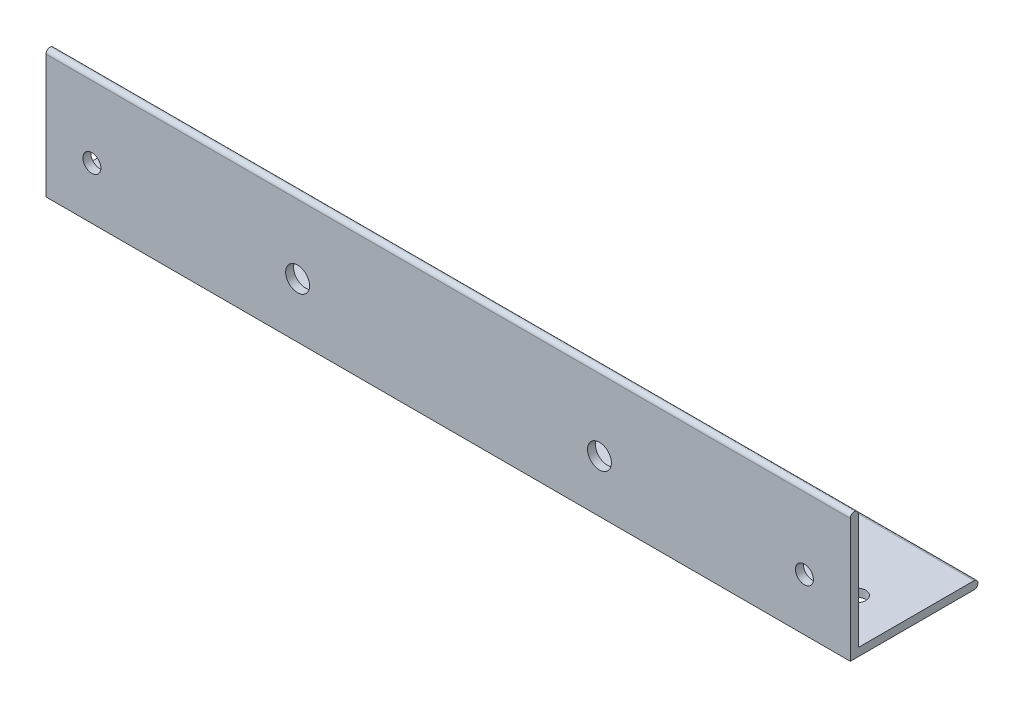
ISO-10303-21;
HEADER;
FILE_DESCRIPTION(('STEP AP214'),'2;1');
FILE_NAME('part.step','',(''),(''),'','','');
FILE_SCHEMA(('AUTOMOTIVE_DESIGN { 1 0 10303 214 1 1 1 1 }'));
ENDSEC;
DATA;
#1=APPLICATION_CONTEXT('core data for automotive mechanical design processes');
#2=APPLICATION_PROTOCOL_DEFINITION('international standard','automotive_design',2000,#1);
#3=PRODUCT_CONTEXT('',#1,'mechanical');
#4=PRODUCT('Part','Part','',(#3));
#5=PRODUCT_RELATED_PRODUCT_CATEGORY('part','',(#4));
#6=PRODUCT_DEFINITION_FORMATION('','',#4);
#7=PRODUCT_DEFINITION_CONTEXT('part definition',#1,'design');
#8=PRODUCT_DEFINITION('design','',#6,#7);
#9=PRODUCT_DEFINITION_SHAPE('','',#8);
#10=(LENGTH_UNIT() NAMED_UNIT(*) SI_UNIT(.MILLI.,.METRE.));
#11=(NAMED_UNIT(*) PLANE_ANGLE_UNIT() SI_UNIT($,.RADIAN.));
#12=(NAMED_UNIT(*) SI_UNIT($,.STERADIAN.) SOLID_ANGLE_UNIT());
#13=UNCERTAINTY_MEASURE_WITH_UNIT(LENGTH_MEASURE(1.E-05),#10,'distance_accuracy_value','');
#14=(GEOMETRIC_REPRESENTATION_CONTEXT(3) GLOBAL_UNCERTAINTY_ASSIGNED_CONTEXT((#13)) GLOBAL_UNIT_ASSIGNED_CONTEXT((#10,
#11,#12)) REPRESENTATION_CONTEXT('',''));
#15=CARTESIAN_POINT('',(0.,0.,0.));
#16=DIRECTION('',(0.,0.,1.));
#17=DIRECTION('',(1.,0.,0.));
#18=AXIS2_PLACEMENT_3D('',#15,#16,#17);
#19=CARTESIAN_POINT('',(160.,0.793749999999999,-24.60625));
#20=DIRECTION('',(-1.,0.,0.));
#21=DIRECTION('',(0.,0.,1.));
#22=AXIS2_PLACEMENT_3D('',#19,#20,#21);
#23=CYLINDRICAL_SURFACE('',#22,0.793749999999999);
#24=DIRECTION('',(-1.,0.,0.));
#25=VECTOR('',#24,1.);
#26=CARTESIAN_POINT('',(160.,1.5875,-24.60625));
#27=LINE('',#26,#25);
#28=CARTESIAN_POINT('',(160.,1.5875,-24.60625));
#29=VERTEX_POINT('',#28);
#30=CARTESIAN_POINT('',(0.,1.5875,-24.60625));
#31=VERTEX_POINT('',#30);
#32=EDGE_CURVE('E135',#29,#31,#27,.T.);
#33=ORIENTED_EDGE('',*,*,#32,.F.);
#34=CARTESIAN_POINT('',(160.,0.793749999999999,-24.60625));
#35=DIRECTION('',(-1.,0.,0.));
#36=DIRECTION('',(0.,0.,1.));
#37=AXIS2_PLACEMENT_3D('',#34,#35,#36);
#38=CIRCLE('',#37,0.793749999999999);
#39=CARTESIAN_POINT('',(160.,0.,-24.60625));
#40=VERTEX_POINT('',#39);
#41=EDGE_CURVE('E44',#40,#29,#38,.F.);
#42=ORIENTED_EDGE('',*,*,#41,.F.);
#43=DIRECTION('',(-1.,0.,0.));
#44=VECTOR('',#43,1.);
#45=CARTESIAN_POINT('',(160.,0.,-24.60625));
#46=LINE('',#45,#44);
#47=CARTESIAN_POINT('',(0.,0.,-24.60625));
#48=VERTEX_POINT('',#47);
#49=EDGE_CURVE('E137',#48,#40,#46,.F.);
#50=ORIENTED_EDGE('',*,*,#49,.F.);
#51=CARTESIAN_POINT('',(0.,0.793749999999999,-24.60625));
#52=DIRECTION('',(-1.,0.,0.));
#53=DIRECTION('',(0.,0.,1.));
#54=AXIS2_PLACEMENT_3D('',#51,#52,#53);
#55=CIRCLE('',#54,0.793749999999999);
#56=EDGE_CURVE('E11',#31,#48,#55,.T.);
#57=ORIENTED_EDGE('',*,*,#56,.F.);
#58=EDGE_LOOP('',(#33,#42,#50,#57));
#59=FACE_BOUND('',#58,.T.);
#60=ADVANCED_FACE('F35',(#59),#23,.T.);
#61=CARTESIAN_POINT('',(160.,24.60625,-0.79375));
#62=DIRECTION('',(-1.,0.,0.));
#63=DIRECTION('',(0.,0.,1.));
#64=AXIS2_PLACEMENT_3D('',#61,#62,#63);
#65=CYLINDRICAL_SURFACE('',#64,0.79375);
#66=DIRECTION('',(-1.,0.,0.));
#67=VECTOR('',#66,1.);
#68=CARTESIAN_POINT('',(160.,24.60625,0.));
#69=LINE('',#68,#67);
#70=CARTESIAN_POINT('',(160.,24.60625,0.));
#71=VERTEX_POINT('',#70);
#72=CARTESIAN_POINT('',(0.,24.60625,0.));
#73=VERTEX_POINT('',#72);
#74=EDGE_CURVE('E105',#71,#73,#69,.T.);
#75=ORIENTED_EDGE('',*,*,#74,.F.);
#76=CARTESIAN_POINT('',(160.,24.60625,-0.79375));
#77=DIRECTION('',(-1.,0.,0.));
#78=DIRECTION('',(0.,0.,1.));
#79=AXIS2_PLACEMENT_3D('',#76,#77,#78);
#80=CIRCLE('',#79,0.79375);
#81=CARTESIAN_POINT('',(160.,24.60625,-1.5875));
#82=VERTEX_POINT('',#81);
#83=EDGE_CURVE('E131',#82,#71,#80,.F.);
#84=ORIENTED_EDGE('',*,*,#83,.F.);
#85=DIRECTION('',(-1.,0.,0.));
#86=VECTOR('',#85,1.);
#87=CARTESIAN_POINT('',(160.,24.60625,-1.5875));
#88=LINE('',#87,#86);
#89=CARTESIAN_POINT('',(0.,24.60625,-1.5875));
#90=VERTEX_POINT('',#89);
#91=EDGE_CURVE('E111',#90,#82,#88,.F.);
#92=ORIENTED_EDGE('',*,*,#91,.F.);
#93=CARTESIAN_POINT('',(0.,24.60625,-0.79375));
#94=DIRECTION('',(-1.,0.,0.));
#95=DIRECTION('',(0.,0.,1.));
#96=AXIS2_PLACEMENT_3D('',#93,#94,#95);
#97=CIRCLE('',#96,0.79375);
#98=EDGE_CURVE('E133',#73,#90,#97,.T.);
#99=ORIENTED_EDGE('',*,*,#98,.F.);
#100=EDGE_LOOP('',(#75,#84,#92,#99));
#101=FACE_BOUND('',#100,.T.);
#102=ADVANCED_FACE('F196',(#101),#65,.T.);
#103=CARTESIAN_POINT('',(160.,0.,-25.4));
#104=DIRECTION('',(0.,1.,0.));
#105=DIRECTION('',(0.,0.,1.));
#106=AXIS2_PLACEMENT_3D('',#103,#104,#105);
#107=PLANE('',#106);
#108=CARTESIAN_POINT('',(55.,0.,-12.7));
#109=DIRECTION('',(0.,-1.,0.));
#110=DIRECTION('',(0.,0.,-1.));
#111=AXIS2_PLACEMENT_3D('',#108,#109,#110);
#112=CIRCLE('',#111,1.785);
#113=CARTESIAN_POINT('',(55.,0.,-14.485));
#114=VERTEX_POINT('',#113);
#115=EDGE_CURVE('E147',#114,#114,#112,.T.);
#116=ORIENTED_EDGE('',*,*,#115,.F.);
#117=EDGE_LOOP('',(#116));
#118=FACE_BOUND('',#117,.T.);
#119=CARTESIAN_POINT('',(105.,0.,-12.7));
#120=DIRECTION('',(0.,-1.,0.));
#121=DIRECTION('',(0.,0.,-1.));
#122=AXIS2_PLACEMENT_3D('',#119,#120,#121);
#123=CIRCLE('',#122,1.78499999999999);
#124=CARTESIAN_POINT('',(105.,0.,-14.485));
#125=VERTEX_POINT('',#124);
#126=EDGE_CURVE('E153',#125,#125,#123,.T.);
#127=ORIENTED_EDGE('',*,*,#126,.F.);
#128=EDGE_LOOP('',(#127));
#129=FACE_BOUND('',#128,.T.);
#130=CARTESIAN_POINT('',(9.13,0.,-10.41));
#131=DIRECTION('',(0.,-1.,0.));
#132=DIRECTION('',(0.,0.,1.));
#133=AXIS2_PLACEMENT_3D('',#130,#131,#132);
#134=CIRCLE('',#133,1.785);
#135=CARTESIAN_POINT('',(9.13,0.,-8.625));
#136=VERTEX_POINT('',#135);
#137=EDGE_CURVE('E143',#136,#136,#134,.T.);
#138=ORIENTED_EDGE('',*,*,#137,.F.);
#139=EDGE_LOOP('',(#138));
#140=FACE_BOUND('',#139,.T.);
#141=CARTESIAN_POINT('',(150.87,0.,-10.41));
#142=DIRECTION('',(0.,-1.,0.));
#143=DIRECTION('',(0.,0.,-1.));
#144=AXIS2_PLACEMENT_3D('',#141,#142,#143);
#145=CIRCLE('',#144,1.78500000000001);
#146=CARTESIAN_POINT('',(150.87,0.,-12.195));
#147=VERTEX_POINT('',#146);
#148=EDGE_CURVE('E181',#147,#147,#145,.T.);
#149=ORIENTED_EDGE('',*,*,#148,.F.);
#150=EDGE_LOOP('',(#149));
#151=FACE_BOUND('',#150,.T.);
#152=DIRECTION('',(0.,0.,-1.));
#153=VECTOR('',#152,1.);
#154=CARTESIAN_POINT('',(0.,0.,-25.4));
#155=LINE('',#154,#153);
#156=CARTESIAN_POINT('',(0.,0.,0.));
#157=VERTEX_POINT('',#156);
#158=EDGE_CURVE('E117',#157,#48,#155,.T.);
#159=ORIENTED_EDGE('',*,*,#158,.T.);
#160=ORIENTED_EDGE('',*,*,#49,.T.);
#161=DIRECTION('',(0.,0.,-1.));
#162=VECTOR('',#161,1.);
#163=CARTESIAN_POINT('',(160.,0.,-25.4));
#164=LINE('',#163,#162);
#165=CARTESIAN_POINT('',(160.,0.,0.));
#166=VERTEX_POINT('',#165);
#167=EDGE_CURVE('E96',#166,#40,#164,.T.);
#168=ORIENTED_EDGE('',*,*,#167,.F.);
#169=DIRECTION('',(-1.,0.,0.));
#170=VECTOR('',#169,1.);
#171=CARTESIAN_POINT('',(160.,0.,0.));
#172=LINE('',#171,#170);
#173=EDGE_CURVE('E106',#166,#157,#172,.T.);
#174=ORIENTED_EDGE('',*,*,#173,.T.);
#175=EDGE_LOOP('',(#159,#160,#168,#174));
#176=FACE_BOUND('',#175,.T.);
#177=ADVANCED_FACE('F191',(#118,#129,#140,#151,#176),#107,.F.);
#178=CARTESIAN_POINT('',(160.,1.5875,-1.5875));
#179=DIRECTION('',(0.,-1.,0.));
#180=DIRECTION('',(0.,0.,-1.));
#181=AXIS2_PLACEMENT_3D('',#178,#179,#180);
#182=PLANE('',#181);
#183=CARTESIAN_POINT('',(55.,1.5875,-12.7));
#184=DIRECTION('',(0.,-1.,0.));
#185=DIRECTION('',(0.,0.,-1.));
#186=AXIS2_PLACEMENT_3D('',#183,#184,#185);
#187=CIRCLE('',#186,1.785);
#188=CARTESIAN_POINT('',(55.,1.5875,-14.485));
#189=VERTEX_POINT('',#188);
#190=EDGE_CURVE('E39',#189,#189,#187,.T.);
#191=ORIENTED_EDGE('',*,*,#190,.T.);
#192=EDGE_LOOP('',(#191));
#193=FACE_BOUND('',#192,.T.);
#194=CARTESIAN_POINT('',(105.,1.5875,-12.7));
#195=DIRECTION('',(0.,-1.,0.));
#196=DIRECTION('',(0.,0.,-1.));
#197=AXIS2_PLACEMENT_3D('',#194,#195,#196);
#198=CIRCLE('',#197,1.78499999999999);
#199=CARTESIAN_POINT('',(105.,1.5875,-14.485));
#200=VERTEX_POINT('',#199);
#201=EDGE_CURVE('E145',#200,#200,#198,.T.);
#202=ORIENTED_EDGE('',*,*,#201,.T.);
#203=EDGE_LOOP('',(#202));
#204=FACE_BOUND('',#203,.T.);
#205=CARTESIAN_POINT('',(9.13,1.5875,-10.41));
#206=DIRECTION('',(0.,-1.,0.));
#207=DIRECTION('',(0.,0.,-1.));
#208=AXIS2_PLACEMENT_3D('',#205,#206,#207);
#209=CIRCLE('',#208,1.785);
#210=CARTESIAN_POINT('',(9.13,1.5875,-12.195));
#211=VERTEX_POINT('',#210);
#212=EDGE_CURVE('E120',#211,#211,#209,.T.);
#213=ORIENTED_EDGE('',*,*,#212,.T.);
#214=EDGE_LOOP('',(#213));
#215=FACE_BOUND('',#214,.T.);
#216=CARTESIAN_POINT('',(150.87,1.5875,-10.41));
#217=DIRECTION('',(0.,-1.,0.));
#218=DIRECTION('',(0.,0.,-1.));
#219=AXIS2_PLACEMENT_3D('',#216,#217,#218);
#220=CIRCLE('',#219,1.78500000000001);
#221=CARTESIAN_POINT('',(150.87,1.5875,-12.195));
#222=VERTEX_POINT('',#221);
#223=EDGE_CURVE('E140',#222,#222,#220,.T.);
#224=ORIENTED_EDGE('',*,*,#223,.T.);
#225=EDGE_LOOP('',(#224));
#226=FACE_BOUND('',#225,.T.);
#227=DIRECTION('',(0.,0.,1.));
#228=VECTOR('',#227,1.);
#229=CARTESIAN_POINT('',(160.,1.5875,-1.5875));
#230=LINE('',#229,#228);
#231=CARTESIAN_POINT('',(160.,1.5875,-1.5875));
#232=VERTEX_POINT('',#231);
#233=EDGE_CURVE('E88',#29,#232,#230,.T.);
#234=ORIENTED_EDGE('',*,*,#233,.F.);
#235=ORIENTED_EDGE('',*,*,#32,.T.);
#236=DIRECTION('',(0.,0.,1.));
#237=VECTOR('',#236,1.);
#238=CARTESIAN_POINT('',(0.,1.5875,-1.5875));
#239=LINE('',#238,#237);
#240=CARTESIAN_POINT('',(0.,1.5875,-1.5875));
#241=VERTEX_POINT('',#240);
#242=EDGE_CURVE('E101',#31,#241,#239,.T.);
#243=ORIENTED_EDGE('',*,*,#242,.T.);
#244=DIRECTION('',(-1.,0.,0.));
#245=VECTOR('',#244,1.);
#246=CARTESIAN_POINT('',(160.,1.5875,-1.5875));
#247=LINE('',#246,#245);
#248=EDGE_CURVE('E99',#232,#241,#247,.T.);
#249=ORIENTED_EDGE('',*,*,#248,.F.);
#250=EDGE_LOOP('',(#234,#235,#243,#249));
#251=FACE_BOUND('',#250,.T.);
#252=ADVANCED_FACE('F100',(#193,#204,#215,#226,#251),#182,.F.);
#253=CARTESIAN_POINT('',(160.,25.4,-1.5875));
#254=DIRECTION('',(0.,0.,1.));
#255=DIRECTION('',(0.,-1.,0.));
#256=AXIS2_PLACEMENT_3D('',#253,#254,#255);
#257=PLANE('',#256);
#258=CARTESIAN_POINT('',(50.05000042,10.905,-1.5875));
#259=DIRECTION('',(0.,0.,1.));
#260=DIRECTION('',(0.,-1.,0.));
#261=AXIS2_PLACEMENT_3D('',#258,#259,#260);
#262=CIRCLE('',#261,2.38125);
#263=CARTESIAN_POINT('',(50.05000042,8.52374999999999,-1.5875));
#264=VERTEX_POINT('',#263);
#265=EDGE_CURVE('E168',#264,#264,#262,.T.);
#266=ORIENTED_EDGE('',*,*,#265,.T.);
#267=EDGE_LOOP('',(#266));
#268=FACE_BOUND('',#267,.T.);
#269=CARTESIAN_POINT('',(110.09999958,10.405,-1.5875));
#270=DIRECTION('',(0.,0.,1.));
#271=DIRECTION('',(0.,-1.,0.));
#272=AXIS2_PLACEMENT_3D('',#269,#270,#271);
#273=CIRCLE('',#272,2.38125000000001);
#274=CARTESIAN_POINT('',(110.09999958,8.02374999999999,-1.5875));
#275=VERTEX_POINT('',#274);
#276=EDGE_CURVE('E163',#275,#275,#273,.T.);
#277=ORIENTED_EDGE('',*,*,#276,.T.);
#278=EDGE_LOOP('',(#277));
#279=FACE_BOUND('',#278,.T.);
#280=CARTESIAN_POINT('',(9.13,10.41,-1.5875));
#281=DIRECTION('',(0.,0.,1.));
#282=DIRECTION('',(0.,1.,0.));
#283=AXIS2_PLACEMENT_3D('',#280,#281,#282);
#284=CIRCLE('',#283,1.78500000000001);
#285=CARTESIAN_POINT('',(9.13,12.195,-1.5875));
#286=VERTEX_POINT('',#285);
#287=EDGE_CURVE('E171',#286,#286,#284,.T.);
#288=ORIENTED_EDGE('',*,*,#287,.T.);
#289=EDGE_LOOP('',(#288));
#290=FACE_BOUND('',#289,.T.);
#291=CARTESIAN_POINT('',(150.87,10.41,-1.5875));
#292=DIRECTION('',(0.,0.,-1.));
#293=DIRECTION('',(0.,1.,0.));
#294=AXIS2_PLACEMENT_3D('',#291,#292,#293);
#295=CIRCLE('',#294,1.78500000000001);
#296=CARTESIAN_POINT('',(150.87,12.195,-1.5875));
#297=VERTEX_POINT('',#296);
#298=EDGE_CURVE('E175',#297,#297,#295,.T.);
#299=ORIENTED_EDGE('',*,*,#298,.F.);
#300=EDGE_LOOP('',(#299));
#301=FACE_BOUND('',#300,.T.);
#302=DIRECTION('',(0.,1.,0.));
#303=VECTOR('',#302,1.);
#304=CARTESIAN_POINT('',(0.,25.4,-1.5875));
#305=LINE('',#304,#303);
#306=EDGE_CURVE('E122',#241,#90,#305,.T.);
#307=ORIENTED_EDGE('',*,*,#306,.T.);
#308=ORIENTED_EDGE('',*,*,#91,.T.);
#309=DIRECTION('',(0.,1.,0.));
#310=VECTOR('',#309,1.);
#311=CARTESIAN_POINT('',(160.,25.4,-1.5875));
#312=LINE('',#311,#310);
#313=EDGE_CURVE('E93',#232,#82,#312,.T.);
#314=ORIENTED_EDGE('',*,*,#313,.F.);
#315=ORIENTED_EDGE('',*,*,#248,.T.);
#316=EDGE_LOOP('',(#307,#308,#314,#315));
#317=FACE_BOUND('',#316,.T.);
#318=ADVANCED_FACE('F109',(#268,#279,#290,#301,#317),#257,.F.);
#319=CARTESIAN_POINT('',(160.,0.,0.));
#320=DIRECTION('',(0.,0.,-1.));
#321=DIRECTION('',(-1.,0.,0.));
#322=AXIS2_PLACEMENT_3D('',#319,#320,#321);
#323=PLANE('',#322);
#324=CARTESIAN_POINT('',(50.05000042,10.905,0.));
#325=DIRECTION('',(0.,0.,1.));
#326=DIRECTION('',(1.,0.,0.));
#327=AXIS2_PLACEMENT_3D('',#324,#325,#326);
#328=CIRCLE('',#327,2.38125);
#329=CARTESIAN_POINT('',(52.43125042,10.905,0.));
#330=VERTEX_POINT('',#329);
#331=EDGE_CURVE('E160',#330,#330,#328,.T.);
#332=ORIENTED_EDGE('',*,*,#331,.F.);
#333=EDGE_LOOP('',(#332));
#334=FACE_BOUND('',#333,.T.);
#335=CARTESIAN_POINT('',(110.09999958,10.405,0.));
#336=DIRECTION('',(0.,0.,1.));
#337=DIRECTION('',(1.,0.,0.));
#338=AXIS2_PLACEMENT_3D('',#335,#336,#337);
#339=CIRCLE('',#338,2.38125000000001);
#340=CARTESIAN_POINT('',(112.48124958,10.405,0.));
#341=VERTEX_POINT('',#340);
#342=EDGE_CURVE('E151',#341,#341,#339,.T.);
#343=ORIENTED_EDGE('',*,*,#342,.F.);
#344=EDGE_LOOP('',(#343));
#345=FACE_BOUND('',#344,.T.);
#346=CARTESIAN_POINT('',(9.13,10.41,0.));
#347=DIRECTION('',(0.,0.,1.));
#348=DIRECTION('',(0.,1.,0.));
#349=AXIS2_PLACEMENT_3D('',#346,#347,#348);
#350=CIRCLE('',#349,1.78500000000001);
#351=CARTESIAN_POINT('',(9.13,12.195,0.));
#352=VERTEX_POINT('',#351);
#353=EDGE_CURVE('E172',#352,#352,#350,.T.);
#354=ORIENTED_EDGE('',*,*,#353,.F.);
#355=EDGE_LOOP('',(#354));
#356=FACE_BOUND('',#355,.T.);
#357=CARTESIAN_POINT('',(150.87,10.41,0.));
#358=DIRECTION('',(0.,0.,-1.));
#359=DIRECTION('',(0.,1.,0.));
#360=AXIS2_PLACEMENT_3D('',#357,#358,#359);
#361=CIRCLE('',#360,1.78500000000001);
#362=CARTESIAN_POINT('',(150.87,12.195,0.));
#363=VERTEX_POINT('',#362);
#364=EDGE_CURVE('E178',#363,#363,#361,.T.);
#365=ORIENTED_EDGE('',*,*,#364,.T.);
#366=EDGE_LOOP('',(#365));
#367=FACE_BOUND('',#366,.T.);
#368=DIRECTION('',(0.,-1.,0.));
#369=VECTOR('',#368,1.);
#370=CARTESIAN_POINT('',(160.,0.,0.));
#371=LINE('',#370,#369);
#372=EDGE_CURVE('E112',#71,#166,#371,.T.);
#373=ORIENTED_EDGE('',*,*,#372,.F.);
#374=ORIENTED_EDGE('',*,*,#74,.T.);
#375=DIRECTION('',(0.,-1.,0.));
#376=VECTOR('',#375,1.);
#377=CARTESIAN_POINT('',(0.,0.,0.));
#378=LINE('',#377,#376);
#379=EDGE_CURVE('E124',#73,#157,#378,.T.);
#380=ORIENTED_EDGE('',*,*,#379,.T.);
#381=ORIENTED_EDGE('',*,*,#173,.F.);
#382=EDGE_LOOP('',(#373,#374,#380,#381));
#383=FACE_BOUND('',#382,.T.);
#384=ADVANCED_FACE('F198',(#334,#345,#356,#367,#383),#323,.F.);
#385=CARTESIAN_POINT('',(160.,0.,0.));
#386=DIRECTION('',(-1.,0.,0.));
#387=DIRECTION('',(0.,0.,1.));
#388=AXIS2_PLACEMENT_3D('',#385,#386,#387);
#389=PLANE('',#388);
#390=ORIENTED_EDGE('',*,*,#167,.T.);
#391=ORIENTED_EDGE('',*,*,#41,.T.);
#392=ORIENTED_EDGE('',*,*,#233,.T.);
#393=ORIENTED_EDGE('',*,*,#313,.T.);
#394=ORIENTED_EDGE('',*,*,#83,.T.);
#395=ORIENTED_EDGE('',*,*,#372,.T.);
#396=EDGE_LOOP('',(#390,#391,#392,#393,#394,#395));
#397=FACE_BOUND('',#396,.T.);
#398=ADVANCED_FACE('F91',(#397),#389,.F.);
#399=CARTESIAN_POINT('',(0.,0.,0.));
#400=DIRECTION('',(-1.,0.,0.));
#401=DIRECTION('',(0.,0.,1.));
#402=AXIS2_PLACEMENT_3D('',#399,#400,#401);
#403=PLANE('',#402);
#404=ORIENTED_EDGE('',*,*,#242,.F.);
#405=ORIENTED_EDGE('',*,*,#56,.T.);
#406=ORIENTED_EDGE('',*,*,#158,.F.);
#407=ORIENTED_EDGE('',*,*,#379,.F.);
#408=ORIENTED_EDGE('',*,*,#98,.T.);
#409=ORIENTED_EDGE('',*,*,#306,.F.);
#410=EDGE_LOOP('',(#404,#405,#406,#407,#408,#409));
#411=FACE_BOUND('',#410,.T.);
#412=ADVANCED_FACE('F192',(#411),#403,.T.);
#413=CARTESIAN_POINT('',(150.87,25.4,-10.41));
#414=DIRECTION('',(0.,-1.,0.));
#415=DIRECTION('',(0.,0.,-1.));
#416=AXIS2_PLACEMENT_3D('',#413,#414,#415);
#417=CYLINDRICAL_SURFACE('',#416,1.78500000000001);
#418=ORIENTED_EDGE('',*,*,#148,.T.);
#419=EDGE_LOOP('',(#418));
#420=FACE_BOUND('',#419,.T.);
#421=ORIENTED_EDGE('',*,*,#223,.F.);
#422=EDGE_LOOP('',(#421));
#423=FACE_BOUND('',#422,.T.);
#424=ADVANCED_FACE('F235',(#420,#423),#417,.F.);
#425=CARTESIAN_POINT('',(9.13,25.4,-10.41));
#426=DIRECTION('',(0.,-1.,0.));
#427=DIRECTION('',(0.,0.,-1.));
#428=AXIS2_PLACEMENT_3D('',#425,#426,#427);
#429=CYLINDRICAL_SURFACE('',#428,1.785);
#430=ORIENTED_EDGE('',*,*,#137,.T.);
#431=EDGE_LOOP('',(#430));
#432=FACE_BOUND('',#431,.T.);
#433=ORIENTED_EDGE('',*,*,#212,.F.);
#434=EDGE_LOOP('',(#433));
#435=FACE_BOUND('',#434,.T.);
#436=ADVANCED_FACE('F237',(#432,#435),#429,.F.);
#437=CARTESIAN_POINT('',(150.87,10.41,0.));
#438=DIRECTION('',(0.,0.,-1.));
#439=DIRECTION('',(0.,1.,0.));
#440=AXIS2_PLACEMENT_3D('',#437,#438,#439);
#441=CYLINDRICAL_SURFACE('',#440,1.78500000000001);
#442=ORIENTED_EDGE('',*,*,#364,.F.);
#443=EDGE_LOOP('',(#442));
#444=FACE_BOUND('',#443,.T.);
#445=ORIENTED_EDGE('',*,*,#298,.T.);
#446=EDGE_LOOP('',(#445));
#447=FACE_BOUND('',#446,.T.);
#448=ADVANCED_FACE('F244',(#444,#447),#441,.F.);
#449=CARTESIAN_POINT('',(9.13,10.41,0.));
#450=DIRECTION('',(0.,0.,-1.));
#451=DIRECTION('',(0.,1.,0.));
#452=AXIS2_PLACEMENT_3D('',#449,#450,#451);
#453=CYLINDRICAL_SURFACE('',#452,1.78500000000001);
#454=ORIENTED_EDGE('',*,*,#353,.T.);
#455=EDGE_LOOP('',(#454));
#456=FACE_BOUND('',#455,.T.);
#457=ORIENTED_EDGE('',*,*,#287,.F.);
#458=EDGE_LOOP('',(#457));
#459=FACE_BOUND('',#458,.T.);
#460=ADVANCED_FACE('F250',(#456,#459),#453,.F.);
#461=CARTESIAN_POINT('',(110.09999958,10.405,-10.));
#462=DIRECTION('',(0.,0.,1.));
#463=DIRECTION('',(1.,0.,0.));
#464=AXIS2_PLACEMENT_3D('',#461,#462,#463);
#465=CYLINDRICAL_SURFACE('',#464,2.38125000000001);
#466=ORIENTED_EDGE('',*,*,#342,.T.);
#467=EDGE_LOOP('',(#466));
#468=FACE_BOUND('',#467,.T.);
#469=ORIENTED_EDGE('',*,*,#276,.F.);
#470=EDGE_LOOP('',(#469));
#471=FACE_BOUND('',#470,.T.);
#472=ADVANCED_FACE('F254',(#468,#471),#465,.F.);
#473=CARTESIAN_POINT('',(50.05000042,10.905,-10.));
#474=DIRECTION('',(0.,0.,1.));
#475=DIRECTION('',(1.,0.,0.));
#476=AXIS2_PLACEMENT_3D('',#473,#474,#475);
#477=CYLINDRICAL_SURFACE('',#476,2.38125);
#478=ORIENTED_EDGE('',*,*,#331,.T.);
#479=EDGE_LOOP('',(#478));
#480=FACE_BOUND('',#479,.T.);
#481=ORIENTED_EDGE('',*,*,#265,.F.);
#482=EDGE_LOOP('',(#481));
#483=FACE_BOUND('',#482,.T.);
#484=ADVANCED_FACE('F258',(#480,#483),#477,.F.);
#485=CARTESIAN_POINT('',(105.,10.,-12.7));
#486=DIRECTION('',(0.,-1.,0.));
#487=DIRECTION('',(0.,0.,-1.));
#488=AXIS2_PLACEMENT_3D('',#485,#486,#487);
#489=CYLINDRICAL_SURFACE('',#488,1.78499999999999);
#490=ORIENTED_EDGE('',*,*,#126,.T.);
#491=EDGE_LOOP('',(#490));
#492=FACE_BOUND('',#491,.T.);
#493=ORIENTED_EDGE('',*,*,#201,.F.);
#494=EDGE_LOOP('',(#493));
#495=FACE_BOUND('',#494,.T.);
#496=ADVANCED_FACE('F262',(#492,#495),#489,.F.);
#497=CARTESIAN_POINT('',(55.,10.,-12.7));
#498=DIRECTION('',(0.,-1.,0.));
#499=DIRECTION('',(0.,0.,-1.));
#500=AXIS2_PLACEMENT_3D('',#497,#498,#499);
#501=CYLINDRICAL_SURFACE('',#500,1.785);
#502=ORIENTED_EDGE('',*,*,#115,.T.);
#503=EDGE_LOOP('',(#502));
#504=FACE_BOUND('',#503,.T.);
#505=ORIENTED_EDGE('',*,*,#190,.F.);
#506=EDGE_LOOP('',(#505));
#507=FACE_BOUND('',#506,.T.);
#508=ADVANCED_FACE('F266',(#504,#507),#501,.F.);
#509=CLOSED_SHELL('',(#60,#102,#177,#252,#318,#384,#398,#412,#424,#436,#448,#460,#472,#484,#496,#508));
#510=MANIFOLD_SOLID_BREP('B2',#509);
#511=ADVANCED_BREP_SHAPE_REPRESENTATION('',(#18,#510),#14);
#512=SHAPE_DEFINITION_REPRESENTATION(#9,#511);
ENDSEC;
END-ISO-10303-21;
